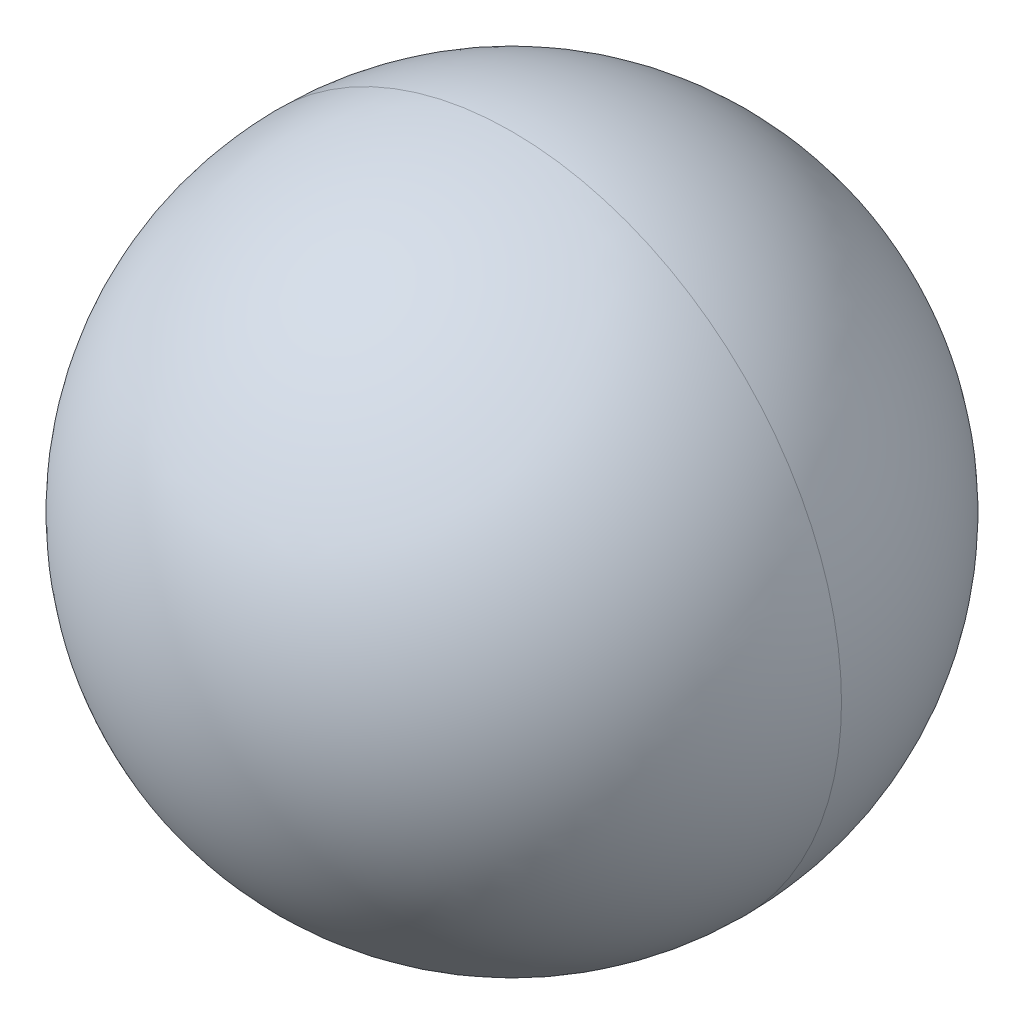
ISO-10303-21;
HEADER;
FILE_DESCRIPTION(('STEP AP214'),'2;1');
FILE_NAME('part.step','',(''),(''),'','','');
FILE_SCHEMA(('AUTOMOTIVE_DESIGN { 1 0 10303 214 1 1 1 1 }'));
ENDSEC;
DATA;
#1=APPLICATION_CONTEXT('core data for automotive mechanical design processes');
#2=APPLICATION_PROTOCOL_DEFINITION('international standard','automotive_design',2000,#1);
#3=PRODUCT_CONTEXT('',#1,'mechanical');
#4=PRODUCT('Part','Part','',(#3));
#5=PRODUCT_RELATED_PRODUCT_CATEGORY('part','',(#4));
#6=PRODUCT_DEFINITION_FORMATION('','',#4);
#7=PRODUCT_DEFINITION_CONTEXT('part definition',#1,'design');
#8=PRODUCT_DEFINITION('design','',#6,#7);
#9=PRODUCT_DEFINITION_SHAPE('','',#8);
#10=(LENGTH_UNIT() NAMED_UNIT(*) SI_UNIT(.MILLI.,.METRE.));
#11=(NAMED_UNIT(*) PLANE_ANGLE_UNIT() SI_UNIT($,.RADIAN.));
#12=(NAMED_UNIT(*) SI_UNIT($,.STERADIAN.) SOLID_ANGLE_UNIT());
#13=UNCERTAINTY_MEASURE_WITH_UNIT(LENGTH_MEASURE(1.E-05),#10,'distance_accuracy_value','');
#14=(GEOMETRIC_REPRESENTATION_CONTEXT(3) GLOBAL_UNCERTAINTY_ASSIGNED_CONTEXT((#13)) GLOBAL_UNIT_ASSIGNED_CONTEXT((#10,
#11,#12)) REPRESENTATION_CONTEXT('',''));
#15=CARTESIAN_POINT('',(0.,0.,0.));
#16=DIRECTION('',(0.,0.,1.));
#17=DIRECTION('',(1.,0.,0.));
#18=AXIS2_PLACEMENT_3D('',#15,#16,#17);
#19=CARTESIAN_POINT('',(0.,2.75,0.));
#20=DIRECTION('',(0.,0.,1.));
#21=DIRECTION('',(1.,0.,0.));
#22=AXIS2_PLACEMENT_3D('',#19,#20,#21);
#23=SPHERICAL_SURFACE('',#22,0.75);
#24=CARTESIAN_POINT('',(0.,2.75,0.));
#25=DIRECTION('',(0.,0.,1.));
#26=DIRECTION('',(1.,0.,0.));
#27=AXIS2_PLACEMENT_3D('',#24,#25,#26);
#28=CIRCLE('',#27,0.75);
#29=CARTESIAN_POINT('',(0.,3.5,0.));
#30=VERTEX_POINT('',#29);
#31=CARTESIAN_POINT('',(0.,2.,0.));
#32=VERTEX_POINT('',#31);
#33=EDGE_CURVE('E11',#30,#32,#28,.T.);
#34=ORIENTED_EDGE('',*,*,#33,.F.);
#35=CARTESIAN_POINT('',(0.,2.75,0.));
#36=DIRECTION('',(0.,0.,-1.));
#37=DIRECTION('',(-1.,0.,0.));
#38=AXIS2_PLACEMENT_3D('',#35,#36,#37);
#39=CIRCLE('',#38,0.75);
#40=EDGE_CURVE('E21',#30,#32,#39,.T.);
#41=ORIENTED_EDGE('',*,*,#40,.T.);
#42=EDGE_LOOP('',(#34,#41));
#43=FACE_BOUND('',#42,.T.);
#44=ADVANCED_FACE('F17',(#43),#23,.T.);
#45=CARTESIAN_POINT('',(0.,2.75,0.));
#46=DIRECTION('',(0.,0.,1.));
#47=DIRECTION('',(1.,0.,0.));
#48=AXIS2_PLACEMENT_3D('',#45,#46,#47);
#49=SPHERICAL_SURFACE('',#48,0.75);
#50=ORIENTED_EDGE('',*,*,#40,.F.);
#51=ORIENTED_EDGE('',*,*,#33,.T.);
#52=EDGE_LOOP('',(#50,#51));
#53=FACE_BOUND('',#52,.T.);
#54=ADVANCED_FACE('F19',(#53),#49,.T.);
#55=CLOSED_SHELL('',(#44,#54));
#56=MANIFOLD_SOLID_BREP('B1',#55);
#57=ADVANCED_BREP_SHAPE_REPRESENTATION('',(#18,#56),#14);
#58=SHAPE_DEFINITION_REPRESENTATION(#9,#57);
ENDSEC;
END-ISO-10303-21;
